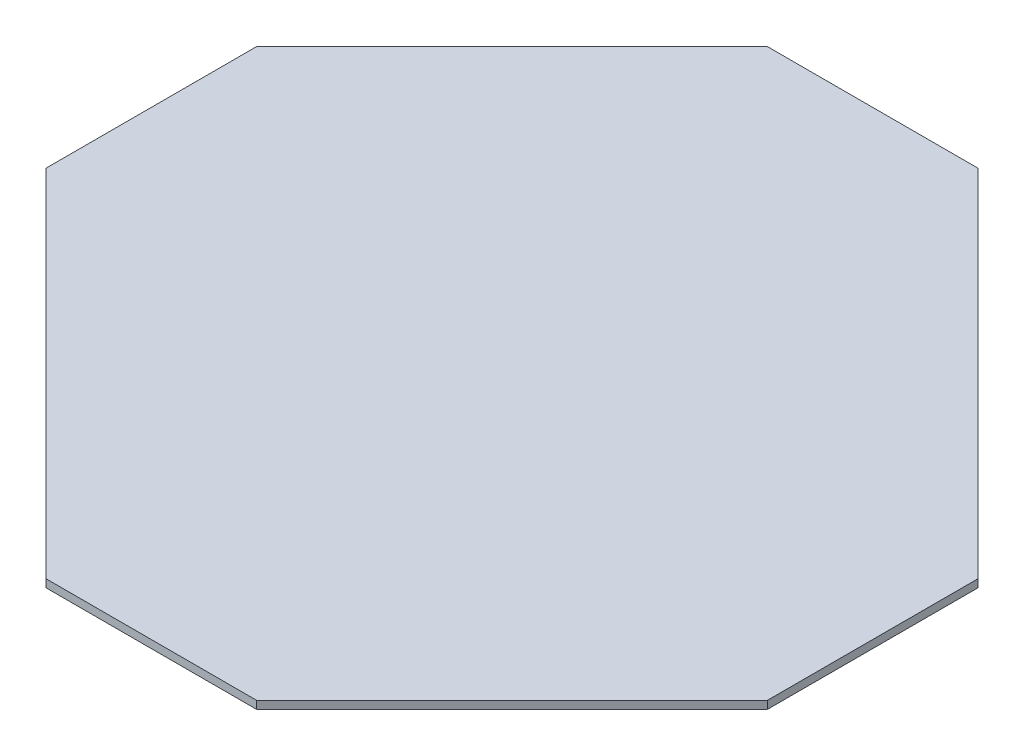
ISO-10303-21;
HEADER;
FILE_DESCRIPTION(('STEP AP214'),'2;1');
FILE_NAME('part.step','',(''),(''),'','','');
FILE_SCHEMA(('AUTOMOTIVE_DESIGN { 1 0 10303 214 1 1 1 1 }'));
ENDSEC;
DATA;
#1=APPLICATION_CONTEXT('core data for automotive mechanical design processes');
#2=APPLICATION_PROTOCOL_DEFINITION('international standard','automotive_design',2000,#1);
#3=PRODUCT_CONTEXT('',#1,'mechanical');
#4=PRODUCT('Part','Part','',(#3));
#5=PRODUCT_RELATED_PRODUCT_CATEGORY('part','',(#4));
#6=PRODUCT_DEFINITION_FORMATION('','',#4);
#7=PRODUCT_DEFINITION_CONTEXT('part definition',#1,'design');
#8=PRODUCT_DEFINITION('design','',#6,#7);
#9=PRODUCT_DEFINITION_SHAPE('','',#8);
#10=(LENGTH_UNIT() NAMED_UNIT(*) SI_UNIT(.MILLI.,.METRE.));
#11=(NAMED_UNIT(*) PLANE_ANGLE_UNIT() SI_UNIT($,.RADIAN.));
#12=(NAMED_UNIT(*) SI_UNIT($,.STERADIAN.) SOLID_ANGLE_UNIT());
#13=UNCERTAINTY_MEASURE_WITH_UNIT(LENGTH_MEASURE(1.E-05),#10,'distance_accuracy_value','');
#14=(GEOMETRIC_REPRESENTATION_CONTEXT(3) GLOBAL_UNCERTAINTY_ASSIGNED_CONTEXT((#13)) GLOBAL_UNIT_ASSIGNED_CONTEXT((#10,
#11,#12)) REPRESENTATION_CONTEXT('',''));
#15=CARTESIAN_POINT('',(0.,0.,0.));
#16=DIRECTION('',(0.,0.,1.));
#17=DIRECTION('',(1.,0.,0.));
#18=AXIS2_PLACEMENT_3D('',#15,#16,#17);
#19=CARTESIAN_POINT('',(-68.75,3.,-165.97718241315));
#20=DIRECTION('',(0.707106781186547,0.,0.707106781186548));
#21=DIRECTION('',(0.707106781186548,0.,-0.707106781186547));
#22=AXIS2_PLACEMENT_3D('',#19,#20,#21);
#23=PLANE('',#22);
#24=DIRECTION('',(-0.707106781186548,0.,0.707106781186547));
#25=VECTOR('',#24,1.);
#26=CARTESIAN_POINT('',(-68.75,0.,-165.97718241315));
#27=LINE('',#26,#25);
#28=CARTESIAN_POINT('',(-68.75,0.,-165.97718241315));
#29=VERTEX_POINT('',#28);
#30=CARTESIAN_POINT('',(-165.97718241315,0.,-68.7500000000001));
#31=VERTEX_POINT('',#30);
#32=EDGE_CURVE('E140',#29,#31,#27,.T.);
#33=ORIENTED_EDGE('',*,*,#32,.T.);
#34=DIRECTION('',(0.,-1.,0.));
#35=VECTOR('',#34,1.);
#36=CARTESIAN_POINT('',(-165.97718241315,3.,-68.7500000000001));
#37=LINE('',#36,#35);
#38=CARTESIAN_POINT('',(-165.97718241315,3.,-68.7500000000001));
#39=VERTEX_POINT('',#38);
#40=EDGE_CURVE('E11',#39,#31,#37,.T.);
#41=ORIENTED_EDGE('',*,*,#40,.F.);
#42=DIRECTION('',(-0.707106781186548,0.,0.707106781186547));
#43=VECTOR('',#42,1.);
#44=CARTESIAN_POINT('',(-68.75,3.,-165.97718241315));
#45=LINE('',#44,#43);
#46=CARTESIAN_POINT('',(-68.75,3.,-165.97718241315));
#47=VERTEX_POINT('',#46);
#48=EDGE_CURVE('E162',#47,#39,#45,.T.);
#49=ORIENTED_EDGE('',*,*,#48,.F.);
#50=DIRECTION('',(0.,-1.,0.));
#51=VECTOR('',#50,1.);
#52=CARTESIAN_POINT('',(-68.75,3.,-165.97718241315));
#53=LINE('',#52,#51);
#54=EDGE_CURVE('E136',#47,#29,#53,.T.);
#55=ORIENTED_EDGE('',*,*,#54,.T.);
#56=EDGE_LOOP('',(#33,#41,#49,#55));
#57=FACE_BOUND('',#56,.T.);
#58=ADVANCED_FACE('F39',(#57),#23,.F.);
#59=CARTESIAN_POINT('',(-165.97718241315,3.,-68.7500000000001));
#60=DIRECTION('',(1.,0.,0.));
#61=DIRECTION('',(0.,0.,-1.));
#62=AXIS2_PLACEMENT_3D('',#59,#60,#61);
#63=PLANE('',#62);
#64=DIRECTION('',(0.,0.,1.));
#65=VECTOR('',#64,1.);
#66=CARTESIAN_POINT('',(-165.97718241315,0.,-68.7500000000001));
#67=LINE('',#66,#65);
#68=CARTESIAN_POINT('',(-165.97718241315,0.,11.5066196646739));
#69=VERTEX_POINT('',#68);
#70=EDGE_CURVE('E144',#31,#69,#67,.T.);
#71=ORIENTED_EDGE('',*,*,#70,.T.);
#72=DIRECTION('',(0.,-1.,0.));
#73=VECTOR('',#72,1.);
#74=CARTESIAN_POINT('',(-165.97718241315,3.,11.5066196646739));
#75=LINE('',#74,#73);
#76=CARTESIAN_POINT('',(-165.97718241315,3.,11.5066196646739));
#77=VERTEX_POINT('',#76);
#78=EDGE_CURVE('E48',#77,#69,#75,.T.);
#79=ORIENTED_EDGE('',*,*,#78,.F.);
#80=DIRECTION('',(0.,0.,1.));
#81=VECTOR('',#80,1.);
#82=CARTESIAN_POINT('',(-165.97718241315,3.,-68.7500000000001));
#83=LINE('',#82,#81);
#84=EDGE_CURVE('E99',#39,#77,#83,.T.);
#85=ORIENTED_EDGE('',*,*,#84,.F.);
#86=ORIENTED_EDGE('',*,*,#40,.T.);
#87=EDGE_LOOP('',(#71,#79,#85,#86));
#88=FACE_BOUND('',#87,.T.);
#89=ADVANCED_FACE('F208',(#88),#63,.F.);
#90=CARTESIAN_POINT('',(-165.97718241315,3.,11.5066196646739));
#91=DIRECTION('',(0.707106781186544,0.,-0.707106781186551));
#92=DIRECTION('',(-0.707106781186551,0.,-0.707106781186544));
#93=AXIS2_PLACEMENT_3D('',#90,#91,#92);
#94=PLANE('',#93);
#95=DIRECTION('',(0.707106781186551,0.,0.707106781186544));
#96=VECTOR('',#95,1.);
#97=CARTESIAN_POINT('',(-165.97718241315,0.,11.5066196646739));
#98=LINE('',#97,#96);
#99=CARTESIAN_POINT('',(-30.5662338159264,0.,146.917568261896));
#100=VERTEX_POINT('',#99);
#101=EDGE_CURVE('E147',#69,#100,#98,.T.);
#102=ORIENTED_EDGE('',*,*,#101,.T.);
#103=DIRECTION('',(0.,-1.,0.));
#104=VECTOR('',#103,1.);
#105=CARTESIAN_POINT('',(-30.5662338159264,3.,146.917568261896));
#106=LINE('',#105,#104);
#107=CARTESIAN_POINT('',(-30.5662338159264,3.,146.917568261896));
#108=VERTEX_POINT('',#107);
#109=EDGE_CURVE('E173',#108,#100,#106,.T.);
#110=ORIENTED_EDGE('',*,*,#109,.F.);
#111=DIRECTION('',(0.707106781186551,0.,0.707106781186544));
#112=VECTOR('',#111,1.);
#113=CARTESIAN_POINT('',(-165.97718241315,3.,11.5066196646739));
#114=LINE('',#113,#112);
#115=EDGE_CURVE('E183',#77,#108,#114,.T.);
#116=ORIENTED_EDGE('',*,*,#115,.F.);
#117=ORIENTED_EDGE('',*,*,#78,.T.);
#118=EDGE_LOOP('',(#102,#110,#116,#117));
#119=FACE_BOUND('',#118,.T.);
#120=ADVANCED_FACE('F181',(#119),#94,.F.);
#121=CARTESIAN_POINT('',(49.6903858487474,3.,146.917568261896));
#122=DIRECTION('',(0.,0.,-1.));
#123=DIRECTION('',(-1.,0.,0.));
#124=AXIS2_PLACEMENT_3D('',#121,#122,#123);
#125=PLANE('',#124);
#126=DIRECTION('',(1.,0.,0.));
#127=VECTOR('',#126,1.);
#128=CARTESIAN_POINT('',(49.6903858487474,0.,146.917568261896));
#129=LINE('',#128,#127);
#130=CARTESIAN_POINT('',(49.6903858487474,0.,146.917568261896));
#131=VERTEX_POINT('',#130);
#132=EDGE_CURVE('E150',#100,#131,#129,.T.);
#133=ORIENTED_EDGE('',*,*,#132,.T.);
#134=DIRECTION('',(0.,-1.,0.));
#135=VECTOR('',#134,1.);
#136=CARTESIAN_POINT('',(49.6903858487474,3.,146.917568261896));
#137=LINE('',#136,#135);
#138=CARTESIAN_POINT('',(49.6903858487474,3.,146.917568261896));
#139=VERTEX_POINT('',#138);
#140=EDGE_CURVE('E169',#139,#131,#137,.T.);
#141=ORIENTED_EDGE('',*,*,#140,.F.);
#142=DIRECTION('',(1.,0.,0.));
#143=VECTOR('',#142,1.);
#144=CARTESIAN_POINT('',(49.6903858487474,3.,146.917568261896));
#145=LINE('',#144,#143);
#146=EDGE_CURVE('E196',#108,#139,#145,.T.);
#147=ORIENTED_EDGE('',*,*,#146,.F.);
#148=ORIENTED_EDGE('',*,*,#109,.T.);
#149=EDGE_LOOP('',(#133,#141,#147,#148));
#150=FACE_BOUND('',#149,.T.);
#151=ADVANCED_FACE('F191',(#150),#125,.F.);
#152=CARTESIAN_POINT('',(49.6903858487474,3.,146.917568261896));
#153=DIRECTION('',(-0.707106781186547,0.,-0.707106781186547));
#154=DIRECTION('',(-0.707106781186548,0.,0.707106781186548));
#155=AXIS2_PLACEMENT_3D('',#152,#153,#154);
#156=PLANE('',#155);
#157=DIRECTION('',(0.707106781186548,0.,-0.707106781186548));
#158=VECTOR('',#157,1.);
#159=CARTESIAN_POINT('',(49.6903858487474,0.,146.917568261896));
#160=LINE('',#159,#158);
#161=CARTESIAN_POINT('',(146.917568261898,0.,49.690385848746));
#162=VERTEX_POINT('',#161);
#163=EDGE_CURVE('E153',#131,#162,#160,.T.);
#164=ORIENTED_EDGE('',*,*,#163,.T.);
#165=DIRECTION('',(0.,-1.,0.));
#166=VECTOR('',#165,1.);
#167=CARTESIAN_POINT('',(146.917568261898,3.,49.690385848746));
#168=LINE('',#167,#166);
#169=CARTESIAN_POINT('',(146.917568261898,3.,49.690385848746));
#170=VERTEX_POINT('',#169);
#171=EDGE_CURVE('E129',#170,#162,#168,.T.);
#172=ORIENTED_EDGE('',*,*,#171,.F.);
#173=DIRECTION('',(0.707106781186548,0.,-0.707106781186548));
#174=VECTOR('',#173,1.);
#175=CARTESIAN_POINT('',(49.6903858487474,3.,146.917568261896));
#176=LINE('',#175,#174);
#177=EDGE_CURVE('E118',#139,#170,#176,.T.);
#178=ORIENTED_EDGE('',*,*,#177,.F.);
#179=ORIENTED_EDGE('',*,*,#140,.T.);
#180=EDGE_LOOP('',(#164,#172,#178,#179));
#181=FACE_BOUND('',#180,.T.);
#182=ADVANCED_FACE('F194',(#181),#156,.F.);
#183=CARTESIAN_POINT('',(146.917568261898,3.,-30.566233815926));
#184=DIRECTION('',(-1.,0.,0.));
#185=DIRECTION('',(0.,0.,1.));
#186=AXIS2_PLACEMENT_3D('',#183,#184,#185);
#187=PLANE('',#186);
#188=DIRECTION('',(0.,0.,-1.));
#189=VECTOR('',#188,1.);
#190=CARTESIAN_POINT('',(146.917568261898,0.,-30.566233815926));
#191=LINE('',#190,#189);
#192=CARTESIAN_POINT('',(146.917568261898,0.,-30.566233815926));
#193=VERTEX_POINT('',#192);
#194=EDGE_CURVE('E127',#162,#193,#191,.T.);
#195=ORIENTED_EDGE('',*,*,#194,.T.);
#196=DIRECTION('',(0.,-1.,0.));
#197=VECTOR('',#196,1.);
#198=CARTESIAN_POINT('',(146.917568261898,3.,-30.566233815926));
#199=LINE('',#198,#197);
#200=CARTESIAN_POINT('',(146.917568261898,3.,-30.566233815926));
#201=VERTEX_POINT('',#200);
#202=EDGE_CURVE('E124',#201,#193,#199,.T.);
#203=ORIENTED_EDGE('',*,*,#202,.F.);
#204=DIRECTION('',(0.,0.,-1.));
#205=VECTOR('',#204,1.);
#206=CARTESIAN_POINT('',(146.917568261898,3.,-30.566233815926));
#207=LINE('',#206,#205);
#208=EDGE_CURVE('E112',#170,#201,#207,.T.);
#209=ORIENTED_EDGE('',*,*,#208,.F.);
#210=ORIENTED_EDGE('',*,*,#171,.T.);
#211=EDGE_LOOP('',(#195,#203,#209,#210));
#212=FACE_BOUND('',#211,.T.);
#213=ADVANCED_FACE('F125',(#212),#187,.F.);
#214=CARTESIAN_POINT('',(146.917568261898,3.,-30.566233815926));
#215=DIRECTION('',(-0.707106781186545,0.,0.707106781186549));
#216=DIRECTION('',(0.707106781186549,0.,0.707106781186546));
#217=AXIS2_PLACEMENT_3D('',#214,#215,#216);
#218=PLANE('',#217);
#219=DIRECTION('',(-0.707106781186549,0.,-0.707106781186546));
#220=VECTOR('',#219,1.);
#221=CARTESIAN_POINT('',(146.917568261898,0.,-30.566233815926));
#222=LINE('',#221,#220);
#223=CARTESIAN_POINT('',(11.5066196646726,0.,-165.97718241315));
#224=VERTEX_POINT('',#223);
#225=EDGE_CURVE('E85',#193,#224,#222,.T.);
#226=ORIENTED_EDGE('',*,*,#225,.T.);
#227=DIRECTION('',(0.,-1.,0.));
#228=VECTOR('',#227,1.);
#229=CARTESIAN_POINT('',(11.5066196646726,3.,-165.97718241315));
#230=LINE('',#229,#228);
#231=CARTESIAN_POINT('',(11.5066196646726,3.,-165.97718241315));
#232=VERTEX_POINT('',#231);
#233=EDGE_CURVE('E130',#232,#224,#230,.T.);
#234=ORIENTED_EDGE('',*,*,#233,.F.);
#235=DIRECTION('',(-0.707106781186549,0.,-0.707106781186546));
#236=VECTOR('',#235,1.);
#237=CARTESIAN_POINT('',(146.917568261898,3.,-30.566233815926));
#238=LINE('',#237,#236);
#239=EDGE_CURVE('E116',#201,#232,#238,.T.);
#240=ORIENTED_EDGE('',*,*,#239,.F.);
#241=ORIENTED_EDGE('',*,*,#202,.T.);
#242=EDGE_LOOP('',(#226,#234,#240,#241));
#243=FACE_BOUND('',#242,.T.);
#244=ADVANCED_FACE('F132',(#243),#218,.F.);
#245=CARTESIAN_POINT('',(11.5066196646726,3.,-165.97718241315));
#246=DIRECTION('',(0.,0.,1.));
#247=DIRECTION('',(1.,0.,0.));
#248=AXIS2_PLACEMENT_3D('',#245,#246,#247);
#249=PLANE('',#248);
#250=DIRECTION('',(-1.,0.,0.));
#251=VECTOR('',#250,1.);
#252=CARTESIAN_POINT('',(11.5066196646726,0.,-165.97718241315));
#253=LINE('',#252,#251);
#254=EDGE_CURVE('E91',#224,#29,#253,.T.);
#255=ORIENTED_EDGE('',*,*,#254,.T.);
#256=ORIENTED_EDGE('',*,*,#54,.F.);
#257=DIRECTION('',(-1.,0.,0.));
#258=VECTOR('',#257,1.);
#259=CARTESIAN_POINT('',(11.5066196646726,3.,-165.97718241315));
#260=LINE('',#259,#258);
#261=EDGE_CURVE('E56',#232,#47,#260,.T.);
#262=ORIENTED_EDGE('',*,*,#261,.F.);
#263=ORIENTED_EDGE('',*,*,#233,.T.);
#264=EDGE_LOOP('',(#255,#256,#262,#263));
#265=FACE_BOUND('',#264,.T.);
#266=ADVANCED_FACE('F224',(#265),#249,.F.);
#267=CARTESIAN_POINT('',(0.,3.,0.));
#268=DIRECTION('',(0.,1.,0.));
#269=DIRECTION('',(0.,0.,1.));
#270=AXIS2_PLACEMENT_3D('',#267,#268,#269);
#271=PLANE('',#270);
#272=ORIENTED_EDGE('',*,*,#48,.T.);
#273=ORIENTED_EDGE('',*,*,#84,.T.);
#274=ORIENTED_EDGE('',*,*,#115,.T.);
#275=ORIENTED_EDGE('',*,*,#146,.T.);
#276=ORIENTED_EDGE('',*,*,#177,.T.);
#277=ORIENTED_EDGE('',*,*,#208,.T.);
#278=ORIENTED_EDGE('',*,*,#239,.T.);
#279=ORIENTED_EDGE('',*,*,#261,.T.);
#280=EDGE_LOOP('',(#272,#273,#274,#275,#276,#277,#278,#279));
#281=FACE_BOUND('',#280,.T.);
#282=ADVANCED_FACE('F114',(#281),#271,.T.);
#283=CARTESIAN_POINT('',(0.,0.,0.));
#284=DIRECTION('',(0.,1.,0.));
#285=DIRECTION('',(0.,0.,1.));
#286=AXIS2_PLACEMENT_3D('',#283,#284,#285);
#287=PLANE('',#286);
#288=ORIENTED_EDGE('',*,*,#32,.F.);
#289=ORIENTED_EDGE('',*,*,#254,.F.);
#290=ORIENTED_EDGE('',*,*,#225,.F.);
#291=ORIENTED_EDGE('',*,*,#194,.F.);
#292=ORIENTED_EDGE('',*,*,#163,.F.);
#293=ORIENTED_EDGE('',*,*,#132,.F.);
#294=ORIENTED_EDGE('',*,*,#101,.F.);
#295=ORIENTED_EDGE('',*,*,#70,.F.);
#296=EDGE_LOOP('',(#288,#289,#290,#291,#292,#293,#294,#295));
#297=FACE_BOUND('',#296,.T.);
#298=ADVANCED_FACE('F187',(#297),#287,.F.);
#299=CLOSED_SHELL('',(#58,#89,#120,#151,#182,#213,#244,#266,#282,#298));
#300=MANIFOLD_SOLID_BREP('B2',#299);
#301=ADVANCED_BREP_SHAPE_REPRESENTATION('',(#18,#300),#14);
#302=SHAPE_DEFINITION_REPRESENTATION(#9,#301);
ENDSEC;
END-ISO-10303-21;
